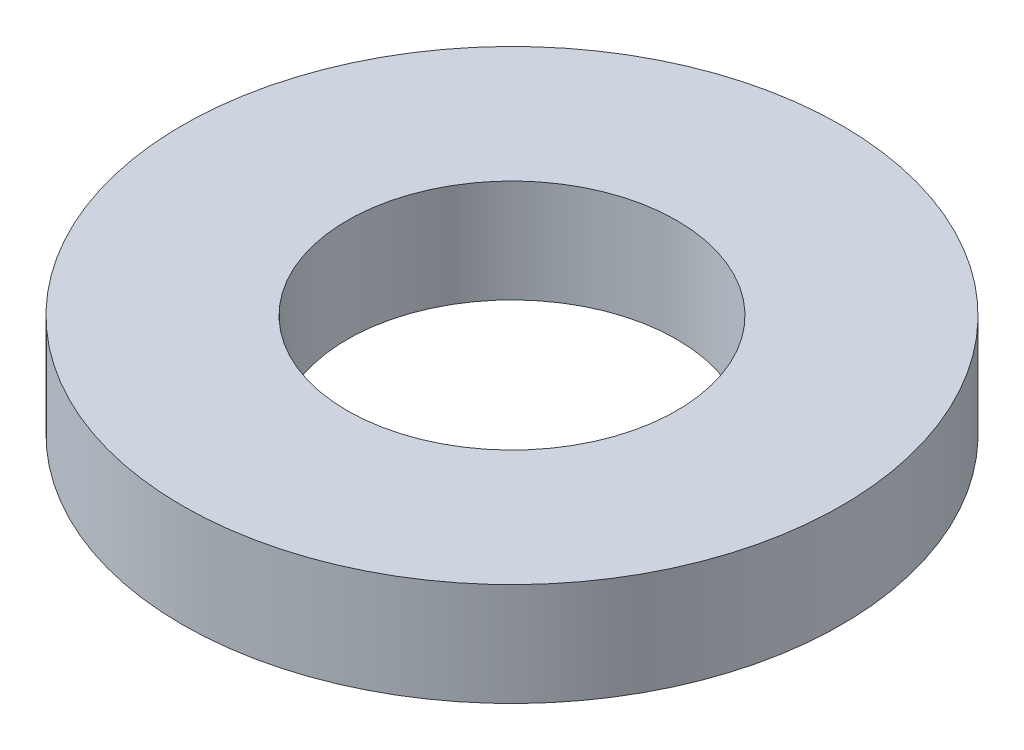
ISO-10303-21;
HEADER;
FILE_DESCRIPTION(('STEP AP214'),'2;1');
FILE_NAME('part.step','',(''),(''),'','','');
FILE_SCHEMA(('AUTOMOTIVE_DESIGN { 1 0 10303 214 1 1 1 1 }'));
ENDSEC;
DATA;
#1=APPLICATION_CONTEXT('core data for automotive mechanical design processes');
#2=APPLICATION_PROTOCOL_DEFINITION('international standard','automotive_design',2000,#1);
#3=PRODUCT_CONTEXT('',#1,'mechanical');
#4=PRODUCT('Part','Part','',(#3));
#5=PRODUCT_RELATED_PRODUCT_CATEGORY('part','',(#4));
#6=PRODUCT_DEFINITION_FORMATION('','',#4);
#7=PRODUCT_DEFINITION_CONTEXT('part definition',#1,'design');
#8=PRODUCT_DEFINITION('design','',#6,#7);
#9=PRODUCT_DEFINITION_SHAPE('','',#8);
#10=(LENGTH_UNIT() NAMED_UNIT(*) SI_UNIT(.MILLI.,.METRE.));
#11=(NAMED_UNIT(*) PLANE_ANGLE_UNIT() SI_UNIT($,.RADIAN.));
#12=(NAMED_UNIT(*) SI_UNIT($,.STERADIAN.) SOLID_ANGLE_UNIT());
#13=UNCERTAINTY_MEASURE_WITH_UNIT(LENGTH_MEASURE(1.E-05),#10,'distance_accuracy_value','');
#14=(GEOMETRIC_REPRESENTATION_CONTEXT(3) GLOBAL_UNCERTAINTY_ASSIGNED_CONTEXT((#13)) GLOBAL_UNIT_ASSIGNED_CONTEXT((#10,
#11,#12)) REPRESENTATION_CONTEXT('',''));
#15=CARTESIAN_POINT('',(0.,0.,0.));
#16=DIRECTION('',(0.,0.,1.));
#17=DIRECTION('',(1.,0.,0.));
#18=AXIS2_PLACEMENT_3D('',#15,#16,#17);
#19=CARTESIAN_POINT('',(0.,25.,0.));
#20=DIRECTION('',(0.,-1.,0.));
#21=DIRECTION('',(0.,0.,-1.));
#22=AXIS2_PLACEMENT_3D('',#19,#20,#21);
#23=CYLINDRICAL_SURFACE('',#22,80.);
#24=CARTESIAN_POINT('',(0.,25.,0.));
#25=DIRECTION('',(0.,1.,0.));
#26=DIRECTION('',(0.,0.,1.));
#27=AXIS2_PLACEMENT_3D('',#24,#25,#26);
#28=CIRCLE('',#27,80.);
#29=CARTESIAN_POINT('',(0.,25.,80.));
#30=VERTEX_POINT('',#29);
#31=EDGE_CURVE('E10',#30,#30,#28,.T.);
#32=ORIENTED_EDGE('',*,*,#31,.F.);
#33=EDGE_LOOP('',(#32));
#34=FACE_BOUND('',#33,.T.);
#35=CARTESIAN_POINT('',(0.,0.,0.));
#36=DIRECTION('',(0.,1.,0.));
#37=DIRECTION('',(0.,0.,1.));
#38=AXIS2_PLACEMENT_3D('',#35,#36,#37);
#39=CIRCLE('',#38,80.);
#40=CARTESIAN_POINT('',(0.,0.,80.));
#41=VERTEX_POINT('',#40);
#42=EDGE_CURVE('E37',#41,#41,#39,.T.);
#43=ORIENTED_EDGE('',*,*,#42,.T.);
#44=EDGE_LOOP('',(#43));
#45=FACE_BOUND('',#44,.T.);
#46=ADVANCED_FACE('F40',(#34,#45),#23,.T.);
#47=CARTESIAN_POINT('',(0.,25.,0.));
#48=DIRECTION('',(0.,1.,0.));
#49=DIRECTION('',(0.,0.,1.));
#50=AXIS2_PLACEMENT_3D('',#47,#48,#49);
#51=PLANE('',#50);
#52=CARTESIAN_POINT('',(0.,25.,0.));
#53=DIRECTION('',(0.,1.,0.));
#54=DIRECTION('',(0.,0.,1.));
#55=AXIS2_PLACEMENT_3D('',#52,#53,#54);
#56=CIRCLE('',#55,40.);
#57=CARTESIAN_POINT('',(0.,25.,40.));
#58=VERTEX_POINT('',#57);
#59=EDGE_CURVE('E50',#58,#58,#56,.T.);
#60=ORIENTED_EDGE('',*,*,#59,.F.);
#61=EDGE_LOOP('',(#60));
#62=FACE_BOUND('',#61,.T.);
#63=ORIENTED_EDGE('',*,*,#31,.T.);
#64=EDGE_LOOP('',(#63));
#65=FACE_BOUND('',#64,.T.);
#66=ADVANCED_FACE('F59',(#62,#65),#51,.T.);
#67=CARTESIAN_POINT('',(0.,0.,0.));
#68=DIRECTION('',(0.,1.,0.));
#69=DIRECTION('',(0.,0.,1.));
#70=AXIS2_PLACEMENT_3D('',#67,#68,#69);
#71=PLANE('',#70);
#72=CARTESIAN_POINT('',(0.,0.,0.));
#73=DIRECTION('',(0.,1.,0.));
#74=DIRECTION('',(0.,0.,1.));
#75=AXIS2_PLACEMENT_3D('',#72,#73,#74);
#76=CIRCLE('',#75,40.);
#77=CARTESIAN_POINT('',(0.,0.,40.));
#78=VERTEX_POINT('',#77);
#79=EDGE_CURVE('E47',#78,#78,#76,.T.);
#80=ORIENTED_EDGE('',*,*,#79,.T.);
#81=EDGE_LOOP('',(#80));
#82=FACE_BOUND('',#81,.T.);
#83=ORIENTED_EDGE('',*,*,#42,.F.);
#84=EDGE_LOOP('',(#83));
#85=FACE_BOUND('',#84,.T.);
#86=ADVANCED_FACE('F58',(#82,#85),#71,.F.);
#87=CARTESIAN_POINT('',(0.,25.,0.));
#88=DIRECTION('',(0.,-1.,0.));
#89=DIRECTION('',(0.,0.,-1.));
#90=AXIS2_PLACEMENT_3D('',#87,#88,#89);
#91=CYLINDRICAL_SURFACE('',#90,40.);
#92=ORIENTED_EDGE('',*,*,#59,.T.);
#93=EDGE_LOOP('',(#92));
#94=FACE_BOUND('',#93,.T.);
#95=ORIENTED_EDGE('',*,*,#79,.F.);
#96=EDGE_LOOP('',(#95));
#97=FACE_BOUND('',#96,.T.);
#98=ADVANCED_FACE('F54',(#94,#97),#91,.F.);
#99=CLOSED_SHELL('',(#46,#66,#86,#98));
#100=MANIFOLD_SOLID_BREP('B2',#99);
#101=ADVANCED_BREP_SHAPE_REPRESENTATION('',(#18,#100),#14);
#102=SHAPE_DEFINITION_REPRESENTATION(#9,#101);
ENDSEC;
END-ISO-10303-21;
